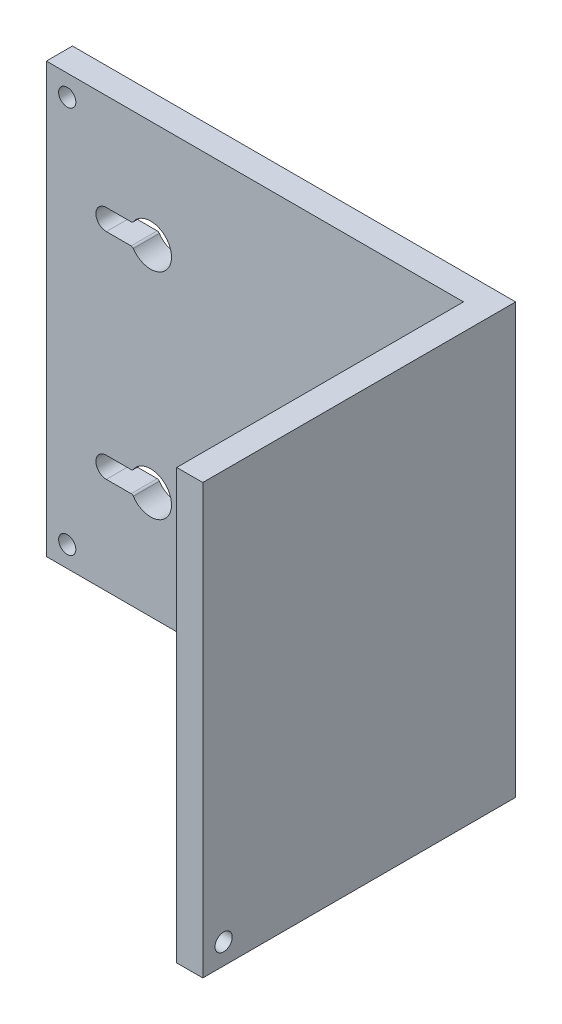
ISO-10303-21;
HEADER;
FILE_DESCRIPTION(('STEP AP214'),'2;1');
FILE_NAME('part.step','',(''),(''),'','','');
FILE_SCHEMA(('AUTOMOTIVE_DESIGN { 1 0 10303 214 1 1 1 1 }'));
ENDSEC;
DATA;
#1=APPLICATION_CONTEXT('core data for automotive mechanical design processes');
#2=APPLICATION_PROTOCOL_DEFINITION('international standard','automotive_design',2000,#1);
#3=PRODUCT_CONTEXT('',#1,'mechanical');
#4=PRODUCT('Part','Part','',(#3));
#5=PRODUCT_RELATED_PRODUCT_CATEGORY('part','',(#4));
#6=PRODUCT_DEFINITION_FORMATION('','',#4);
#7=PRODUCT_DEFINITION_CONTEXT('part definition',#1,'design');
#8=PRODUCT_DEFINITION('design','',#6,#7);
#9=PRODUCT_DEFINITION_SHAPE('','',#8);
#10=(LENGTH_UNIT() NAMED_UNIT(*) SI_UNIT(.MILLI.,.METRE.));
#11=(NAMED_UNIT(*) PLANE_ANGLE_UNIT() SI_UNIT($,.RADIAN.));
#12=(NAMED_UNIT(*) SI_UNIT($,.STERADIAN.) SOLID_ANGLE_UNIT());
#13=UNCERTAINTY_MEASURE_WITH_UNIT(LENGTH_MEASURE(1.E-05),#10,'distance_accuracy_value','');
#14=(GEOMETRIC_REPRESENTATION_CONTEXT(3) GLOBAL_UNCERTAINTY_ASSIGNED_CONTEXT((#13)) GLOBAL_UNIT_ASSIGNED_CONTEXT((#10,
#11,#12)) REPRESENTATION_CONTEXT('',''));
#15=CARTESIAN_POINT('',(0.,0.,0.));
#16=DIRECTION('',(0.,0.,1.));
#17=DIRECTION('',(1.,0.,0.));
#18=AXIS2_PLACEMENT_3D('',#15,#16,#17);
#19=CARTESIAN_POINT('',(0.,0.,0.));
#20=DIRECTION('',(0.,0.,1.));
#21=DIRECTION('',(1.,0.,0.));
#22=AXIS2_PLACEMENT_3D('',#19,#20,#21);
#23=PLANE('',#22);
#24=CARTESIAN_POINT('',(4.,-4.,0.));
#25=DIRECTION('',(0.,0.,-1.));
#26=DIRECTION('',(-1.,0.,0.));
#27=AXIS2_PLACEMENT_3D('',#24,#25,#26);
#28=CIRCLE('',#27,1.65);
#29=CARTESIAN_POINT('',(2.35,-4.,0.));
#30=VERTEX_POINT('',#29);
#31=EDGE_CURVE('E311',#30,#30,#28,.T.);
#32=ORIENTED_EDGE('',*,*,#31,.F.);
#33=EDGE_LOOP('',(#32));
#34=FACE_BOUND('',#33,.T.);
#35=CARTESIAN_POINT('',(3.99999999999999,-78.3,0.));
#36=DIRECTION('',(0.,0.,-1.));
#37=DIRECTION('',(-1.,0.,0.));
#38=AXIS2_PLACEMENT_3D('',#35,#36,#37);
#39=CIRCLE('',#38,1.65);
#40=CARTESIAN_POINT('',(2.34999999999999,-78.3,0.));
#41=VERTEX_POINT('',#40);
#42=EDGE_CURVE('E316',#41,#41,#39,.T.);
#43=ORIENTED_EDGE('',*,*,#42,.F.);
#44=EDGE_LOOP('',(#43));
#45=FACE_BOUND('',#44,.T.);
#46=DIRECTION('',(0.,-1.,0.));
#47=VECTOR('',#46,1.);
#48=CARTESIAN_POINT('',(0.,0.,0.));
#49=LINE('',#48,#47);
#50=CARTESIAN_POINT('',(0.,0.,0.));
#51=VERTEX_POINT('',#50);
#52=CARTESIAN_POINT('',(0.,-82.3,0.));
#53=VERTEX_POINT('',#52);
#54=EDGE_CURVE('E246',#51,#53,#49,.T.);
#55=ORIENTED_EDGE('',*,*,#54,.F.);
#56=DIRECTION('',(-1.,0.,0.));
#57=VECTOR('',#56,1.);
#58=CARTESIAN_POINT('',(0.,0.,0.));
#59=LINE('',#58,#57);
#60=CARTESIAN_POINT('',(85.,0.,0.));
#61=VERTEX_POINT('',#60);
#62=EDGE_CURVE('E253',#61,#51,#59,.T.);
#63=ORIENTED_EDGE('',*,*,#62,.F.);
#64=DIRECTION('',(0.,1.,0.));
#65=VECTOR('',#64,1.);
#66=CARTESIAN_POINT('',(85.,0.,0.));
#67=LINE('',#66,#65);
#68=CARTESIAN_POINT('',(85.,-82.3,0.));
#69=VERTEX_POINT('',#68);
#70=EDGE_CURVE('E263',#69,#61,#67,.T.);
#71=ORIENTED_EDGE('',*,*,#70,.F.);
#72=DIRECTION('',(1.,0.,0.));
#73=VECTOR('',#72,1.);
#74=CARTESIAN_POINT('',(0.,-82.3,0.));
#75=LINE('',#74,#73);
#76=EDGE_CURVE('E261',#53,#69,#75,.T.);
#77=ORIENTED_EDGE('',*,*,#76,.F.);
#78=EDGE_LOOP('',(#55,#63,#71,#77));
#79=FACE_BOUND('',#78,.T.);
#80=CARTESIAN_POINT('',(20.,-61.725,0.));
#81=DIRECTION('',(0.,0.,1.));
#82=DIRECTION('',(1.,0.,0.));
#83=AXIS2_PLACEMENT_3D('',#80,#81,#82);
#84=CIRCLE('',#83,4.);
#85=CARTESIAN_POINT('',(16.6740823228676,-63.9472222222222,0.));
#86=VERTEX_POINT('',#85);
#87=CARTESIAN_POINT('',(16.6740823228676,-59.5027777777778,0.));
#88=VERTEX_POINT('',#87);
#89=EDGE_CURVE('E228',#86,#88,#84,.T.);
#90=ORIENTED_EDGE('',*,*,#89,.T.);
#91=CARTESIAN_POINT('',(16.2583426132261,-59.225,0.));
#92=DIRECTION('',(0.,0.,1.));
#93=DIRECTION('',(1.,0.,0.));
#94=AXIS2_PLACEMENT_3D('',#91,#92,#93);
#95=CIRCLE('',#94,0.5);
#96=CARTESIAN_POINT('',(16.2583426132261,-59.725,0.));
#97=VERTEX_POINT('',#96);
#98=EDGE_CURVE('E290',#88,#97,#95,.F.);
#99=ORIENTED_EDGE('',*,*,#98,.T.);
#100=DIRECTION('',(-1.,0.,0.));
#101=VECTOR('',#100,1.);
#102=CARTESIAN_POINT('',(0.,-59.725,0.));
#103=LINE('',#102,#101);
#104=CARTESIAN_POINT('',(11.5,-59.725,0.));
#105=VERTEX_POINT('',#104);
#106=EDGE_CURVE('E218',#97,#105,#103,.T.);
#107=ORIENTED_EDGE('',*,*,#106,.T.);
#108=CARTESIAN_POINT('',(11.5,-61.725,0.));
#109=DIRECTION('',(0.,0.,1.));
#110=DIRECTION('',(1.,0.,0.));
#111=AXIS2_PLACEMENT_3D('',#108,#109,#110);
#112=CIRCLE('',#111,2.00000000000001);
#113=CARTESIAN_POINT('',(11.5,-63.725,0.));
#114=VERTEX_POINT('',#113);
#115=EDGE_CURVE('E222',#105,#114,#112,.T.);
#116=ORIENTED_EDGE('',*,*,#115,.T.);
#117=DIRECTION('',(1.,0.,0.));
#118=VECTOR('',#117,1.);
#119=CARTESIAN_POINT('',(0.,-63.725,0.));
#120=LINE('',#119,#118);
#121=CARTESIAN_POINT('',(16.2583426132261,-63.725,0.));
#122=VERTEX_POINT('',#121);
#123=EDGE_CURVE('E225',#114,#122,#120,.T.);
#124=ORIENTED_EDGE('',*,*,#123,.T.);
#125=CARTESIAN_POINT('',(16.2583426132261,-64.225,0.));
#126=DIRECTION('',(0.,0.,1.));
#127=DIRECTION('',(1.,0.,0.));
#128=AXIS2_PLACEMENT_3D('',#125,#126,#127);
#129=CIRCLE('',#128,0.5);
#130=EDGE_CURVE('E288',#122,#86,#129,.F.);
#131=ORIENTED_EDGE('',*,*,#130,.T.);
#132=EDGE_LOOP('',(#90,#99,#107,#116,#124,#131));
#133=FACE_BOUND('',#132,.T.);
#134=DIRECTION('',(-1.,0.,0.));
#135=VECTOR('',#134,1.);
#136=CARTESIAN_POINT('',(0.,-22.575,0.));
#137=LINE('',#136,#135);
#138=CARTESIAN_POINT('',(16.2583426132261,-22.575,0.));
#139=VERTEX_POINT('',#138);
#140=CARTESIAN_POINT('',(11.5,-22.575,0.));
#141=VERTEX_POINT('',#140);
#142=EDGE_CURVE('E199',#139,#141,#137,.T.);
#143=ORIENTED_EDGE('',*,*,#142,.F.);
#144=CARTESIAN_POINT('',(16.2583426132261,-23.075,0.));
#145=DIRECTION('',(0.,0.,1.));
#146=DIRECTION('',(1.,0.,0.));
#147=AXIS2_PLACEMENT_3D('',#144,#145,#146);
#148=CIRCLE('',#147,0.5);
#149=CARTESIAN_POINT('',(16.6740823228676,-22.7972222222222,0.));
#150=VERTEX_POINT('',#149);
#151=EDGE_CURVE('E48',#139,#150,#148,.F.);
#152=ORIENTED_EDGE('',*,*,#151,.T.);
#153=CARTESIAN_POINT('',(20.,-20.575,0.));
#154=DIRECTION('',(0.,0.,1.));
#155=DIRECTION('',(1.,0.,0.));
#156=AXIS2_PLACEMENT_3D('',#153,#154,#155);
#157=CIRCLE('',#156,4.);
#158=CARTESIAN_POINT('',(16.6740823228676,-18.3527777777778,0.));
#159=VERTEX_POINT('',#158);
#160=EDGE_CURVE('E201',#159,#150,#157,.F.);
#161=ORIENTED_EDGE('',*,*,#160,.F.);
#162=CARTESIAN_POINT('',(16.2583426132261,-18.075,0.));
#163=DIRECTION('',(0.,0.,1.));
#164=DIRECTION('',(1.,0.,0.));
#165=AXIS2_PLACEMENT_3D('',#162,#163,#164);
#166=CIRCLE('',#165,0.5);
#167=CARTESIAN_POINT('',(16.2583426132261,-18.575,0.));
#168=VERTEX_POINT('',#167);
#169=EDGE_CURVE('E56',#159,#168,#166,.F.);
#170=ORIENTED_EDGE('',*,*,#169,.T.);
#171=DIRECTION('',(1.,0.,0.));
#172=VECTOR('',#171,1.);
#173=CARTESIAN_POINT('',(0.,-18.575,0.));
#174=LINE('',#173,#172);
#175=CARTESIAN_POINT('',(11.5,-18.575,0.));
#176=VERTEX_POINT('',#175);
#177=EDGE_CURVE('E195',#176,#168,#174,.T.);
#178=ORIENTED_EDGE('',*,*,#177,.F.);
#179=CARTESIAN_POINT('',(11.5,-20.575,0.));
#180=DIRECTION('',(0.,0.,1.));
#181=DIRECTION('',(1.,0.,0.));
#182=AXIS2_PLACEMENT_3D('',#179,#180,#181);
#183=CIRCLE('',#182,2.00000000000001);
#184=EDGE_CURVE('E176',#141,#176,#183,.F.);
#185=ORIENTED_EDGE('',*,*,#184,.F.);
#186=EDGE_LOOP('',(#143,#152,#161,#170,#178,#185));
#187=FACE_BOUND('',#186,.T.);
#188=ADVANCED_FACE('F39',(#34,#45,#79,#133,#187),#23,.F.);
#189=CARTESIAN_POINT('',(0.,0.,5.));
#190=DIRECTION('',(0.,0.,-1.));
#191=DIRECTION('',(-1.,0.,0.));
#192=AXIS2_PLACEMENT_3D('',#189,#190,#191);
#193=PLANE('',#192);
#194=CARTESIAN_POINT('',(4.,-4.,5.));
#195=DIRECTION('',(0.,0.,-1.));
#196=DIRECTION('',(-1.,0.,0.));
#197=AXIS2_PLACEMENT_3D('',#194,#195,#196);
#198=CIRCLE('',#197,1.65);
#199=CARTESIAN_POINT('',(2.35,-4.,5.));
#200=VERTEX_POINT('',#199);
#201=EDGE_CURVE('E43',#200,#200,#198,.T.);
#202=ORIENTED_EDGE('',*,*,#201,.T.);
#203=EDGE_LOOP('',(#202));
#204=FACE_BOUND('',#203,.T.);
#205=CARTESIAN_POINT('',(3.99999999999999,-78.3,5.));
#206=DIRECTION('',(0.,0.,-1.));
#207=DIRECTION('',(-1.,0.,0.));
#208=AXIS2_PLACEMENT_3D('',#205,#206,#207);
#209=CIRCLE('',#208,1.65);
#210=CARTESIAN_POINT('',(2.34999999999999,-78.3,5.));
#211=VERTEX_POINT('',#210);
#212=EDGE_CURVE('E309',#211,#211,#209,.T.);
#213=ORIENTED_EDGE('',*,*,#212,.T.);
#214=EDGE_LOOP('',(#213));
#215=FACE_BOUND('',#214,.T.);
#216=DIRECTION('',(1.,0.,0.));
#217=VECTOR('',#216,1.);
#218=CARTESIAN_POINT('',(0.,-82.3,5.));
#219=LINE('',#218,#217);
#220=CARTESIAN_POINT('',(0.,-82.3,5.));
#221=VERTEX_POINT('',#220);
#222=CARTESIAN_POINT('',(80.,-82.3,5.));
#223=VERTEX_POINT('',#222);
#224=EDGE_CURVE('E231',#221,#223,#219,.T.);
#225=ORIENTED_EDGE('',*,*,#224,.T.);
#226=DIRECTION('',(0.,-1.,0.));
#227=VECTOR('',#226,1.);
#228=CARTESIAN_POINT('',(80.,0.,5.));
#229=LINE('',#228,#227);
#230=CARTESIAN_POINT('',(80.,0.,5.));
#231=VERTEX_POINT('',#230);
#232=EDGE_CURVE('E247',#231,#223,#229,.T.);
#233=ORIENTED_EDGE('',*,*,#232,.F.);
#234=DIRECTION('',(1.,0.,0.));
#235=VECTOR('',#234,1.);
#236=CARTESIAN_POINT('',(0.,0.,5.));
#237=LINE('',#236,#235);
#238=CARTESIAN_POINT('',(0.,0.,5.));
#239=VERTEX_POINT('',#238);
#240=EDGE_CURVE('E232',#239,#231,#237,.T.);
#241=ORIENTED_EDGE('',*,*,#240,.F.);
#242=DIRECTION('',(0.,-1.,0.));
#243=VECTOR('',#242,1.);
#244=CARTESIAN_POINT('',(0.,0.,5.));
#245=LINE('',#244,#243);
#246=EDGE_CURVE('E239',#239,#221,#245,.T.);
#247=ORIENTED_EDGE('',*,*,#246,.T.);
#248=EDGE_LOOP('',(#225,#233,#241,#247));
#249=FACE_BOUND('',#248,.T.);
#250=DIRECTION('',(-1.,0.,0.));
#251=VECTOR('',#250,1.);
#252=CARTESIAN_POINT('',(16.5358983848623,-59.725,5.));
#253=LINE('',#252,#251);
#254=CARTESIAN_POINT('',(16.2583426132261,-59.725,5.));
#255=VERTEX_POINT('',#254);
#256=CARTESIAN_POINT('',(11.5,-59.725,5.));
#257=VERTEX_POINT('',#256);
#258=EDGE_CURVE('E207',#255,#257,#253,.T.);
#259=ORIENTED_EDGE('',*,*,#258,.F.);
#260=CARTESIAN_POINT('',(16.2583426132261,-59.225,5.));
#261=DIRECTION('',(0.,0.,-1.));
#262=DIRECTION('',(-1.,0.,0.));
#263=AXIS2_PLACEMENT_3D('',#260,#261,#262);
#264=CIRCLE('',#263,0.5);
#265=CARTESIAN_POINT('',(16.6740823228676,-59.5027777777778,5.));
#266=VERTEX_POINT('',#265);
#267=EDGE_CURVE('E281',#255,#266,#264,.F.);
#268=ORIENTED_EDGE('',*,*,#267,.T.);
#269=CARTESIAN_POINT('',(20.,-61.725,5.));
#270=DIRECTION('',(0.,0.,1.));
#271=DIRECTION('',(1.,0.,0.));
#272=AXIS2_PLACEMENT_3D('',#269,#270,#271);
#273=CIRCLE('',#272,4.);
#274=CARTESIAN_POINT('',(16.6740823228676,-63.9472222222222,5.));
#275=VERTEX_POINT('',#274);
#276=EDGE_CURVE('E204',#275,#266,#273,.T.);
#277=ORIENTED_EDGE('',*,*,#276,.F.);
#278=CARTESIAN_POINT('',(16.2583426132261,-64.225,5.));
#279=DIRECTION('',(0.,0.,-1.));
#280=DIRECTION('',(-1.,0.,0.));
#281=AXIS2_PLACEMENT_3D('',#278,#279,#280);
#282=CIRCLE('',#281,0.5);
#283=CARTESIAN_POINT('',(16.2583426132261,-63.725,5.));
#284=VERTEX_POINT('',#283);
#285=EDGE_CURVE('E279',#275,#284,#282,.F.);
#286=ORIENTED_EDGE('',*,*,#285,.T.);
#287=DIRECTION('',(1.,0.,0.));
#288=VECTOR('',#287,1.);
#289=CARTESIAN_POINT('',(16.5358983848623,-63.725,5.));
#290=LINE('',#289,#288);
#291=CARTESIAN_POINT('',(11.5,-63.725,5.));
#292=VERTEX_POINT('',#291);
#293=EDGE_CURVE('E212',#292,#284,#290,.T.);
#294=ORIENTED_EDGE('',*,*,#293,.F.);
#295=CARTESIAN_POINT('',(11.5,-61.725,5.));
#296=DIRECTION('',(0.,0.,1.));
#297=DIRECTION('',(-1.,0.,0.));
#298=AXIS2_PLACEMENT_3D('',#295,#296,#297);
#299=CIRCLE('',#298,2.00000000000001);
#300=EDGE_CURVE('E209',#257,#292,#299,.T.);
#301=ORIENTED_EDGE('',*,*,#300,.F.);
#302=EDGE_LOOP('',(#259,#268,#277,#286,#294,#301));
#303=FACE_BOUND('',#302,.T.);
#304=CARTESIAN_POINT('',(20.,-20.575,5.));
#305=DIRECTION('',(0.,0.,-1.));
#306=DIRECTION('',(1.,0.,0.));
#307=AXIS2_PLACEMENT_3D('',#304,#305,#306);
#308=CIRCLE('',#307,4.);
#309=CARTESIAN_POINT('',(16.6740823228676,-18.3527777777778,5.));
#310=VERTEX_POINT('',#309);
#311=CARTESIAN_POINT('',(16.6740823228676,-22.7972222222222,5.));
#312=VERTEX_POINT('',#311);
#313=EDGE_CURVE('E186',#310,#312,#308,.T.);
#314=ORIENTED_EDGE('',*,*,#313,.T.);
#315=CARTESIAN_POINT('',(16.2583426132261,-23.075,5.));
#316=DIRECTION('',(0.,0.,-1.));
#317=DIRECTION('',(-1.,0.,0.));
#318=AXIS2_PLACEMENT_3D('',#315,#316,#317);
#319=CIRCLE('',#318,0.5);
#320=CARTESIAN_POINT('',(16.2583426132261,-22.575,5.));
#321=VERTEX_POINT('',#320);
#322=EDGE_CURVE('E301',#312,#321,#319,.F.);
#323=ORIENTED_EDGE('',*,*,#322,.T.);
#324=DIRECTION('',(-1.,0.,0.));
#325=VECTOR('',#324,1.);
#326=CARTESIAN_POINT('',(16.5358983848623,-22.575,5.));
#327=LINE('',#326,#325);
#328=CARTESIAN_POINT('',(11.5,-22.575,5.));
#329=VERTEX_POINT('',#328);
#330=EDGE_CURVE('E179',#321,#329,#327,.T.);
#331=ORIENTED_EDGE('',*,*,#330,.T.);
#332=CARTESIAN_POINT('',(11.5,-20.575,5.));
#333=DIRECTION('',(0.,0.,-1.));
#334=DIRECTION('',(-1.,0.,0.));
#335=AXIS2_PLACEMENT_3D('',#332,#333,#334);
#336=CIRCLE('',#335,2.00000000000001);
#337=CARTESIAN_POINT('',(11.5,-18.575,5.));
#338=VERTEX_POINT('',#337);
#339=EDGE_CURVE('E174',#329,#338,#336,.T.);
#340=ORIENTED_EDGE('',*,*,#339,.T.);
#341=DIRECTION('',(1.,0.,0.));
#342=VECTOR('',#341,1.);
#343=CARTESIAN_POINT('',(16.5358983848623,-18.575,5.));
#344=LINE('',#343,#342);
#345=CARTESIAN_POINT('',(16.2583426132261,-18.575,5.));
#346=VERTEX_POINT('',#345);
#347=EDGE_CURVE('E182',#338,#346,#344,.T.);
#348=ORIENTED_EDGE('',*,*,#347,.T.);
#349=CARTESIAN_POINT('',(16.2583426132261,-18.075,5.));
#350=DIRECTION('',(0.,0.,-1.));
#351=DIRECTION('',(-1.,0.,0.));
#352=AXIS2_PLACEMENT_3D('',#349,#350,#351);
#353=CIRCLE('',#352,0.5);
#354=EDGE_CURVE('E299',#346,#310,#353,.F.);
#355=ORIENTED_EDGE('',*,*,#354,.T.);
#356=EDGE_LOOP('',(#314,#323,#331,#340,#348,#355));
#357=FACE_BOUND('',#356,.T.);
#358=ADVANCED_FACE('F189',(#204,#215,#249,#303,#357),#193,.F.);
#359=CARTESIAN_POINT('',(0.,0.,60.));
#360=DIRECTION('',(1.,0.,0.));
#361=DIRECTION('',(0.,1.,0.));
#362=AXIS2_PLACEMENT_3D('',#359,#360,#361);
#363=PLANE('',#362);
#364=DIRECTION('',(0.,0.,-1.));
#365=VECTOR('',#364,1.);
#366=CARTESIAN_POINT('',(0.,-82.3,60.));
#367=LINE('',#366,#365);
#368=EDGE_CURVE('E274',#221,#53,#367,.T.);
#369=ORIENTED_EDGE('',*,*,#368,.F.);
#370=ORIENTED_EDGE('',*,*,#246,.F.);
#371=DIRECTION('',(0.,0.,-1.));
#372=VECTOR('',#371,1.);
#373=CARTESIAN_POINT('',(0.,0.,60.));
#374=LINE('',#373,#372);
#375=EDGE_CURVE('E258',#239,#51,#374,.T.);
#376=ORIENTED_EDGE('',*,*,#375,.T.);
#377=ORIENTED_EDGE('',*,*,#54,.T.);
#378=EDGE_LOOP('',(#369,#370,#376,#377));
#379=FACE_BOUND('',#378,.T.);
#380=ADVANCED_FACE('F347',(#379),#363,.F.);
#381=CARTESIAN_POINT('',(0.,-82.3,60.));
#382=DIRECTION('',(0.,1.,0.));
#383=DIRECTION('',(0.,0.,1.));
#384=AXIS2_PLACEMENT_3D('',#381,#382,#383);
#385=PLANE('',#384);
#386=DIRECTION('',(1.,0.,0.));
#387=VECTOR('',#386,1.);
#388=CARTESIAN_POINT('',(0.,-82.3,60.));
#389=LINE('',#388,#387);
#390=CARTESIAN_POINT('',(80.,-82.3,60.));
#391=VERTEX_POINT('',#390);
#392=CARTESIAN_POINT('',(85.,-82.3,60.));
#393=VERTEX_POINT('',#392);
#394=EDGE_CURVE('E250',#391,#393,#389,.T.);
#395=ORIENTED_EDGE('',*,*,#394,.F.);
#396=DIRECTION('',(0.,0.,1.));
#397=VECTOR('',#396,1.);
#398=CARTESIAN_POINT('',(80.,-82.3,60.));
#399=LINE('',#398,#397);
#400=EDGE_CURVE('E236',#223,#391,#399,.T.);
#401=ORIENTED_EDGE('',*,*,#400,.F.);
#402=ORIENTED_EDGE('',*,*,#224,.F.);
#403=ORIENTED_EDGE('',*,*,#368,.T.);
#404=ORIENTED_EDGE('',*,*,#76,.T.);
#405=DIRECTION('',(0.,0.,-1.));
#406=VECTOR('',#405,1.);
#407=CARTESIAN_POINT('',(85.,-82.3,60.));
#408=LINE('',#407,#406);
#409=EDGE_CURVE('E271',#393,#69,#408,.T.);
#410=ORIENTED_EDGE('',*,*,#409,.F.);
#411=EDGE_LOOP('',(#395,#401,#402,#403,#404,#410));
#412=FACE_BOUND('',#411,.T.);
#413=ADVANCED_FACE('F361',(#412),#385,.F.);
#414=CARTESIAN_POINT('',(85.,0.,60.));
#415=DIRECTION('',(-1.,0.,0.));
#416=DIRECTION('',(0.,0.,1.));
#417=AXIS2_PLACEMENT_3D('',#414,#415,#416);
#418=PLANE('',#417);
#419=CARTESIAN_POINT('',(85.,-78.3,56.));
#420=DIRECTION('',(1.,0.,0.));
#421=DIRECTION('',(0.,0.,-1.));
#422=AXIS2_PLACEMENT_3D('',#419,#420,#421);
#423=CIRCLE('',#422,1.65);
#424=CARTESIAN_POINT('',(85.,-78.3,54.35));
#425=VERTEX_POINT('',#424);
#426=EDGE_CURVE('E308',#425,#425,#423,.T.);
#427=ORIENTED_EDGE('',*,*,#426,.F.);
#428=EDGE_LOOP('',(#427));
#429=FACE_BOUND('',#428,.T.);
#430=ORIENTED_EDGE('',*,*,#70,.T.);
#431=DIRECTION('',(0.,0.,-1.));
#432=VECTOR('',#431,1.);
#433=CARTESIAN_POINT('',(85.,0.,60.));
#434=LINE('',#433,#432);
#435=CARTESIAN_POINT('',(85.,0.,60.));
#436=VERTEX_POINT('',#435);
#437=EDGE_CURVE('E268',#436,#61,#434,.T.);
#438=ORIENTED_EDGE('',*,*,#437,.F.);
#439=DIRECTION('',(0.,1.,0.));
#440=VECTOR('',#439,1.);
#441=CARTESIAN_POINT('',(85.,0.,60.));
#442=LINE('',#441,#440);
#443=EDGE_CURVE('E252',#393,#436,#442,.T.);
#444=ORIENTED_EDGE('',*,*,#443,.F.);
#445=ORIENTED_EDGE('',*,*,#409,.T.);
#446=EDGE_LOOP('',(#430,#438,#444,#445));
#447=FACE_BOUND('',#446,.T.);
#448=ADVANCED_FACE('F357',(#429,#447),#418,.F.);
#449=CARTESIAN_POINT('',(0.,0.,60.));
#450=DIRECTION('',(0.,-1.,0.));
#451=DIRECTION('',(0.,0.,-1.));
#452=AXIS2_PLACEMENT_3D('',#449,#450,#451);
#453=PLANE('',#452);
#454=ORIENTED_EDGE('',*,*,#240,.T.);
#455=DIRECTION('',(0.,0.,1.));
#456=VECTOR('',#455,1.);
#457=CARTESIAN_POINT('',(80.,0.,60.));
#458=LINE('',#457,#456);
#459=CARTESIAN_POINT('',(80.,0.,60.));
#460=VERTEX_POINT('',#459);
#461=EDGE_CURVE('E235',#231,#460,#458,.T.);
#462=ORIENTED_EDGE('',*,*,#461,.T.);
#463=DIRECTION('',(-1.,0.,0.));
#464=VECTOR('',#463,1.);
#465=CARTESIAN_POINT('',(0.,0.,60.));
#466=LINE('',#465,#464);
#467=EDGE_CURVE('E255',#436,#460,#466,.T.);
#468=ORIENTED_EDGE('',*,*,#467,.F.);
#469=ORIENTED_EDGE('',*,*,#437,.T.);
#470=ORIENTED_EDGE('',*,*,#62,.T.);
#471=ORIENTED_EDGE('',*,*,#375,.F.);
#472=EDGE_LOOP('',(#454,#462,#468,#469,#470,#471));
#473=FACE_BOUND('',#472,.T.);
#474=ADVANCED_FACE('F354',(#473),#453,.F.);
#475=CARTESIAN_POINT('',(0.,0.,60.));
#476=DIRECTION('',(0.,0.,1.));
#477=DIRECTION('',(1.,0.,0.));
#478=AXIS2_PLACEMENT_3D('',#475,#476,#477);
#479=PLANE('',#478);
#480=DIRECTION('',(0.,-1.,0.));
#481=VECTOR('',#480,1.);
#482=CARTESIAN_POINT('',(80.,0.,60.));
#483=LINE('',#482,#481);
#484=EDGE_CURVE('E243',#460,#391,#483,.T.);
#485=ORIENTED_EDGE('',*,*,#484,.T.);
#486=ORIENTED_EDGE('',*,*,#394,.T.);
#487=ORIENTED_EDGE('',*,*,#443,.T.);
#488=ORIENTED_EDGE('',*,*,#467,.T.);
#489=EDGE_LOOP('',(#485,#486,#487,#488));
#490=FACE_BOUND('',#489,.T.);
#491=ADVANCED_FACE('F353',(#490),#479,.T.);
#492=CARTESIAN_POINT('',(80.,0.,60.));
#493=DIRECTION('',(1.,0.,0.));
#494=DIRECTION('',(0.,0.,-1.));
#495=AXIS2_PLACEMENT_3D('',#492,#493,#494);
#496=PLANE('',#495);
#497=CARTESIAN_POINT('',(80.,-78.3,56.));
#498=DIRECTION('',(1.,0.,0.));
#499=DIRECTION('',(0.,0.,-1.));
#500=AXIS2_PLACEMENT_3D('',#497,#498,#499);
#501=CIRCLE('',#500,1.65);
#502=CARTESIAN_POINT('',(80.,-78.3,54.35));
#503=VERTEX_POINT('',#502);
#504=EDGE_CURVE('E306',#503,#503,#501,.T.);
#505=ORIENTED_EDGE('',*,*,#504,.T.);
#506=EDGE_LOOP('',(#505));
#507=FACE_BOUND('',#506,.T.);
#508=ORIENTED_EDGE('',*,*,#400,.T.);
#509=ORIENTED_EDGE('',*,*,#484,.F.);
#510=ORIENTED_EDGE('',*,*,#461,.F.);
#511=ORIENTED_EDGE('',*,*,#232,.T.);
#512=EDGE_LOOP('',(#508,#509,#510,#511));
#513=FACE_BOUND('',#512,.T.);
#514=ADVANCED_FACE('F413',(#507,#513),#496,.F.);
#515=CARTESIAN_POINT('',(20.,-61.725,-45.));
#516=DIRECTION('',(0.,0.,1.));
#517=DIRECTION('',(1.,0.,0.));
#518=AXIS2_PLACEMENT_3D('',#515,#516,#517);
#519=CYLINDRICAL_SURFACE('',#518,4.);
#520=ORIENTED_EDGE('',*,*,#276,.T.);
#521=DIRECTION('',(0.,0.,1.));
#522=VECTOR('',#521,1.);
#523=CARTESIAN_POINT('',(16.6740823228676,-59.5027777777778,-45.));
#524=LINE('',#523,#522);
#525=EDGE_CURVE('E286',#266,#88,#524,.F.);
#526=ORIENTED_EDGE('',*,*,#525,.T.);
#527=ORIENTED_EDGE('',*,*,#89,.F.);
#528=DIRECTION('',(0.,0.,1.));
#529=VECTOR('',#528,1.);
#530=CARTESIAN_POINT('',(16.6740823228676,-63.9472222222222,-45.));
#531=LINE('',#530,#529);
#532=EDGE_CURVE('E283',#86,#275,#531,.T.);
#533=ORIENTED_EDGE('',*,*,#532,.T.);
#534=EDGE_LOOP('',(#520,#526,#527,#533));
#535=FACE_BOUND('',#534,.T.);
#536=ADVANCED_FACE('F389',(#535),#519,.F.);
#537=CARTESIAN_POINT('',(16.5358983848623,-63.725,-45.));
#538=DIRECTION('',(0.,-1.,0.));
#539=DIRECTION('',(0.,0.,-1.));
#540=AXIS2_PLACEMENT_3D('',#537,#538,#539);
#541=PLANE('',#540);
#542=ORIENTED_EDGE('',*,*,#293,.T.);
#543=DIRECTION('',(0.,0.,1.));
#544=VECTOR('',#543,1.);
#545=CARTESIAN_POINT('',(16.2583426132261,-63.725,-45.));
#546=LINE('',#545,#544);
#547=EDGE_CURVE('E292',#284,#122,#546,.F.);
#548=ORIENTED_EDGE('',*,*,#547,.T.);
#549=ORIENTED_EDGE('',*,*,#123,.F.);
#550=DIRECTION('',(0.,0.,1.));
#551=VECTOR('',#550,1.);
#552=CARTESIAN_POINT('',(11.5,-63.725,-45.));
#553=LINE('',#552,#551);
#554=EDGE_CURVE('E216',#114,#292,#553,.T.);
#555=ORIENTED_EDGE('',*,*,#554,.T.);
#556=EDGE_LOOP('',(#542,#548,#549,#555));
#557=FACE_BOUND('',#556,.T.);
#558=ADVANCED_FACE('F404',(#557),#541,.F.);
#559=CARTESIAN_POINT('',(11.5,-61.725,-45.));
#560=DIRECTION('',(0.,0.,1.));
#561=DIRECTION('',(1.,0.,0.));
#562=AXIS2_PLACEMENT_3D('',#559,#560,#561);
#563=CYLINDRICAL_SURFACE('',#562,2.00000000000001);
#564=DIRECTION('',(0.,0.,1.));
#565=VECTOR('',#564,1.);
#566=CARTESIAN_POINT('',(11.5,-59.725,-45.));
#567=LINE('',#566,#565);
#568=EDGE_CURVE('E215',#105,#257,#567,.T.);
#569=ORIENTED_EDGE('',*,*,#568,.T.);
#570=ORIENTED_EDGE('',*,*,#300,.T.);
#571=ORIENTED_EDGE('',*,*,#554,.F.);
#572=ORIENTED_EDGE('',*,*,#115,.F.);
#573=EDGE_LOOP('',(#569,#570,#571,#572));
#574=FACE_BOUND('',#573,.T.);
#575=ADVANCED_FACE('F401',(#574),#563,.F.);
#576=CARTESIAN_POINT('',(16.5358983848623,-59.725,-45.));
#577=DIRECTION('',(0.,1.,0.));
#578=DIRECTION('',(0.,0.,1.));
#579=AXIS2_PLACEMENT_3D('',#576,#577,#578);
#580=PLANE('',#579);
#581=ORIENTED_EDGE('',*,*,#106,.F.);
#582=DIRECTION('',(0.,0.,1.));
#583=VECTOR('',#582,1.);
#584=CARTESIAN_POINT('',(16.2583426132261,-59.725,-45.));
#585=LINE('',#584,#583);
#586=EDGE_CURVE('E276',#97,#255,#585,.T.);
#587=ORIENTED_EDGE('',*,*,#586,.T.);
#588=ORIENTED_EDGE('',*,*,#258,.T.);
#589=ORIENTED_EDGE('',*,*,#568,.F.);
#590=EDGE_LOOP('',(#581,#587,#588,#589));
#591=FACE_BOUND('',#590,.T.);
#592=ADVANCED_FACE('F373',(#591),#580,.F.);
#593=CARTESIAN_POINT('',(16.2583426132261,-59.225,-45.));
#594=DIRECTION('',(0.,0.,1.));
#595=DIRECTION('',(1.,0.,0.));
#596=AXIS2_PLACEMENT_3D('',#593,#594,#595);
#597=CYLINDRICAL_SURFACE('',#596,0.5);
#598=ORIENTED_EDGE('',*,*,#98,.F.);
#599=ORIENTED_EDGE('',*,*,#525,.F.);
#600=ORIENTED_EDGE('',*,*,#267,.F.);
#601=ORIENTED_EDGE('',*,*,#586,.F.);
#602=EDGE_LOOP('',(#598,#599,#600,#601));
#603=FACE_BOUND('',#602,.T.);
#604=ADVANCED_FACE('F369',(#603),#597,.T.);
#605=CARTESIAN_POINT('',(16.2583426132261,-64.225,-45.));
#606=DIRECTION('',(0.,0.,1.));
#607=DIRECTION('',(1.,0.,0.));
#608=AXIS2_PLACEMENT_3D('',#605,#606,#607);
#609=CYLINDRICAL_SURFACE('',#608,0.5);
#610=ORIENTED_EDGE('',*,*,#130,.F.);
#611=ORIENTED_EDGE('',*,*,#547,.F.);
#612=ORIENTED_EDGE('',*,*,#285,.F.);
#613=ORIENTED_EDGE('',*,*,#532,.F.);
#614=EDGE_LOOP('',(#610,#611,#612,#613));
#615=FACE_BOUND('',#614,.T.);
#616=ADVANCED_FACE('F372',(#615),#609,.T.);
#617=CARTESIAN_POINT('',(20.,-20.575,-45.));
#618=DIRECTION('',(0.,0.,1.));
#619=DIRECTION('',(1.,0.,0.));
#620=AXIS2_PLACEMENT_3D('',#617,#618,#619);
#621=CYLINDRICAL_SURFACE('',#620,4.);
#622=ORIENTED_EDGE('',*,*,#160,.T.);
#623=DIRECTION('',(0.,0.,1.));
#624=VECTOR('',#623,1.);
#625=CARTESIAN_POINT('',(16.6740823228676,-22.7972222222222,-45.));
#626=LINE('',#625,#624);
#627=EDGE_CURVE('E296',#150,#312,#626,.T.);
#628=ORIENTED_EDGE('',*,*,#627,.T.);
#629=ORIENTED_EDGE('',*,*,#313,.F.);
#630=DIRECTION('',(0.,0.,1.));
#631=VECTOR('',#630,1.);
#632=CARTESIAN_POINT('',(16.6740823228676,-18.3527777777778,-45.));
#633=LINE('',#632,#631);
#634=EDGE_CURVE('E294',#310,#159,#633,.F.);
#635=ORIENTED_EDGE('',*,*,#634,.T.);
#636=EDGE_LOOP('',(#622,#628,#629,#635));
#637=FACE_BOUND('',#636,.T.);
#638=ADVANCED_FACE('F327',(#637),#621,.F.);
#639=CARTESIAN_POINT('',(16.5358983848623,-22.575,-45.));
#640=DIRECTION('',(0.,1.,0.));
#641=DIRECTION('',(0.,0.,1.));
#642=AXIS2_PLACEMENT_3D('',#639,#640,#641);
#643=PLANE('',#642);
#644=ORIENTED_EDGE('',*,*,#330,.F.);
#645=DIRECTION('',(0.,0.,1.));
#646=VECTOR('',#645,1.);
#647=CARTESIAN_POINT('',(16.2583426132261,-22.575,-45.));
#648=LINE('',#647,#646);
#649=EDGE_CURVE('E64',#321,#139,#648,.F.);
#650=ORIENTED_EDGE('',*,*,#649,.T.);
#651=ORIENTED_EDGE('',*,*,#142,.T.);
#652=DIRECTION('',(0.,0.,1.));
#653=VECTOR('',#652,1.);
#654=CARTESIAN_POINT('',(11.5,-22.575,-45.));
#655=LINE('',#654,#653);
#656=EDGE_CURVE('E178',#141,#329,#655,.T.);
#657=ORIENTED_EDGE('',*,*,#656,.T.);
#658=EDGE_LOOP('',(#644,#650,#651,#657));
#659=FACE_BOUND('',#658,.T.);
#660=ADVANCED_FACE('F380',(#659),#643,.T.);
#661=CARTESIAN_POINT('',(11.5,-20.575,-45.));
#662=DIRECTION('',(0.,0.,1.));
#663=DIRECTION('',(1.,0.,0.));
#664=AXIS2_PLACEMENT_3D('',#661,#662,#663);
#665=CYLINDRICAL_SURFACE('',#664,2.00000000000001);
#666=ORIENTED_EDGE('',*,*,#184,.T.);
#667=DIRECTION('',(0.,0.,1.));
#668=VECTOR('',#667,1.);
#669=CARTESIAN_POINT('',(11.5,-18.575,-45.));
#670=LINE('',#669,#668);
#671=EDGE_CURVE('E169',#176,#338,#670,.T.);
#672=ORIENTED_EDGE('',*,*,#671,.T.);
#673=ORIENTED_EDGE('',*,*,#339,.F.);
#674=ORIENTED_EDGE('',*,*,#656,.F.);
#675=EDGE_LOOP('',(#666,#672,#673,#674));
#676=FACE_BOUND('',#675,.T.);
#677=ADVANCED_FACE('F171',(#676),#665,.F.);
#678=CARTESIAN_POINT('',(16.5358983848623,-18.575,-45.));
#679=DIRECTION('',(0.,-1.,0.));
#680=DIRECTION('',(0.,0.,-1.));
#681=AXIS2_PLACEMENT_3D('',#678,#679,#680);
#682=PLANE('',#681);
#683=ORIENTED_EDGE('',*,*,#177,.T.);
#684=DIRECTION('',(0.,0.,1.));
#685=VECTOR('',#684,1.);
#686=CARTESIAN_POINT('',(16.2583426132261,-18.575,-45.));
#687=LINE('',#686,#685);
#688=EDGE_CURVE('E11',#168,#346,#687,.T.);
#689=ORIENTED_EDGE('',*,*,#688,.T.);
#690=ORIENTED_EDGE('',*,*,#347,.F.);
#691=ORIENTED_EDGE('',*,*,#671,.F.);
#692=EDGE_LOOP('',(#683,#689,#690,#691));
#693=FACE_BOUND('',#692,.T.);
#694=ADVANCED_FACE('F183',(#693),#682,.T.);
#695=CARTESIAN_POINT('',(16.2583426132261,-23.075,-45.));
#696=DIRECTION('',(0.,0.,1.));
#697=DIRECTION('',(1.,0.,0.));
#698=AXIS2_PLACEMENT_3D('',#695,#696,#697);
#699=CYLINDRICAL_SURFACE('',#698,0.5);
#700=ORIENTED_EDGE('',*,*,#151,.F.);
#701=ORIENTED_EDGE('',*,*,#649,.F.);
#702=ORIENTED_EDGE('',*,*,#322,.F.);
#703=ORIENTED_EDGE('',*,*,#627,.F.);
#704=EDGE_LOOP('',(#700,#701,#702,#703));
#705=FACE_BOUND('',#704,.T.);
#706=ADVANCED_FACE('F332',(#705),#699,.T.);
#707=CARTESIAN_POINT('',(16.2583426132261,-18.075,-45.));
#708=DIRECTION('',(0.,0.,1.));
#709=DIRECTION('',(1.,0.,0.));
#710=AXIS2_PLACEMENT_3D('',#707,#708,#709);
#711=CYLINDRICAL_SURFACE('',#710,0.5);
#712=ORIENTED_EDGE('',*,*,#169,.F.);
#713=ORIENTED_EDGE('',*,*,#634,.F.);
#714=ORIENTED_EDGE('',*,*,#354,.F.);
#715=ORIENTED_EDGE('',*,*,#688,.F.);
#716=EDGE_LOOP('',(#712,#713,#714,#715));
#717=FACE_BOUND('',#716,.T.);
#718=ADVANCED_FACE('F41',(#717),#711,.T.);
#719=CARTESIAN_POINT('',(65.,-78.3,56.));
#720=DIRECTION('',(1.,0.,0.));
#721=DIRECTION('',(0.,0.,-1.));
#722=AXIS2_PLACEMENT_3D('',#719,#720,#721);
#723=CYLINDRICAL_SURFACE('',#722,1.65);
#724=ORIENTED_EDGE('',*,*,#426,.T.);
#725=EDGE_LOOP('',(#724));
#726=FACE_BOUND('',#725,.T.);
#727=ORIENTED_EDGE('',*,*,#504,.F.);
#728=EDGE_LOOP('',(#727));
#729=FACE_BOUND('',#728,.T.);
#730=ADVANCED_FACE('F331',(#726,#729),#723,.F.);
#731=CARTESIAN_POINT('',(3.99999999999999,-78.3,20.));
#732=DIRECTION('',(0.,0.,-1.));
#733=DIRECTION('',(-1.,0.,0.));
#734=AXIS2_PLACEMENT_3D('',#731,#732,#733);
#735=CYLINDRICAL_SURFACE('',#734,1.65);
#736=ORIENTED_EDGE('',*,*,#42,.T.);
#737=EDGE_LOOP('',(#736));
#738=FACE_BOUND('',#737,.T.);
#739=ORIENTED_EDGE('',*,*,#212,.F.);
#740=EDGE_LOOP('',(#739));
#741=FACE_BOUND('',#740,.T.);
#742=ADVANCED_FACE('F337',(#738,#741),#735,.F.);
#743=CARTESIAN_POINT('',(4.,-4.,20.));
#744=DIRECTION('',(0.,0.,-1.));
#745=DIRECTION('',(-1.,0.,0.));
#746=AXIS2_PLACEMENT_3D('',#743,#744,#745);
#747=CYLINDRICAL_SURFACE('',#746,1.65);
#748=ORIENTED_EDGE('',*,*,#31,.T.);
#749=EDGE_LOOP('',(#748));
#750=FACE_BOUND('',#749,.T.);
#751=ORIENTED_EDGE('',*,*,#201,.F.);
#752=EDGE_LOOP('',(#751));
#753=FACE_BOUND('',#752,.T.);
#754=ADVANCED_FACE('F482',(#750,#753),#747,.F.);
#755=CLOSED_SHELL('',(#188,#358,#380,#413,#448,#474,#491,#514,#536,#558,#575,#592,#604,#616,
#638,#660,#677,#694,#706,#718,#730,#742,#754));
#756=MANIFOLD_SOLID_BREP('B2',#755);
#757=ADVANCED_BREP_SHAPE_REPRESENTATION('',(#18,#756),#14);
#758=SHAPE_DEFINITION_REPRESENTATION(#9,#757);
ENDSEC;
END-ISO-10303-21;
